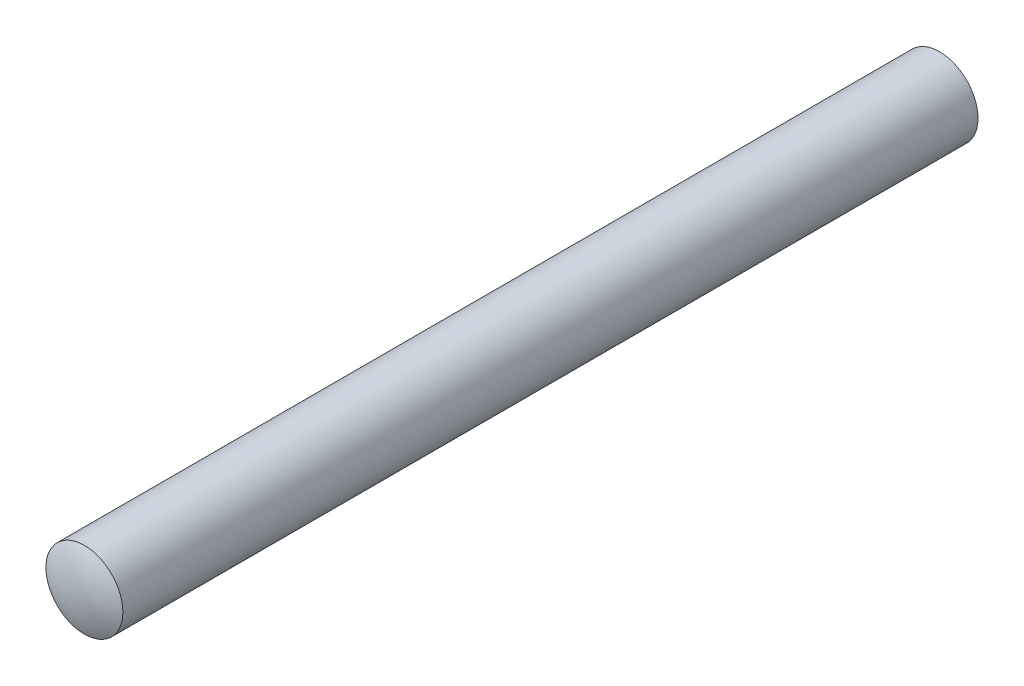
ISO-10303-21;
HEADER;
FILE_DESCRIPTION(('STEP AP214'),'2;1');
FILE_NAME('part.step','',(''),(''),'','','');
FILE_SCHEMA(('AUTOMOTIVE_DESIGN { 1 0 10303 214 1 1 1 1 }'));
ENDSEC;
DATA;
#1=APPLICATION_CONTEXT('core data for automotive mechanical design processes');
#2=APPLICATION_PROTOCOL_DEFINITION('international standard','automotive_design',2000,#1);
#3=PRODUCT_CONTEXT('',#1,'mechanical');
#4=PRODUCT('Part','Part','',(#3));
#5=PRODUCT_RELATED_PRODUCT_CATEGORY('part','',(#4));
#6=PRODUCT_DEFINITION_FORMATION('','',#4);
#7=PRODUCT_DEFINITION_CONTEXT('part definition',#1,'design');
#8=PRODUCT_DEFINITION('design','',#6,#7);
#9=PRODUCT_DEFINITION_SHAPE('','',#8);
#10=(LENGTH_UNIT() NAMED_UNIT(*) SI_UNIT(.MILLI.,.METRE.));
#11=(NAMED_UNIT(*) PLANE_ANGLE_UNIT() SI_UNIT($,.RADIAN.));
#12=(NAMED_UNIT(*) SI_UNIT($,.STERADIAN.) SOLID_ANGLE_UNIT());
#13=UNCERTAINTY_MEASURE_WITH_UNIT(LENGTH_MEASURE(1.E-05),#10,'distance_accuracy_value','');
#14=(GEOMETRIC_REPRESENTATION_CONTEXT(3) GLOBAL_UNCERTAINTY_ASSIGNED_CONTEXT((#13)) GLOBAL_UNIT_ASSIGNED_CONTEXT((#10,
#11,#12)) REPRESENTATION_CONTEXT('',''));
#15=CARTESIAN_POINT('',(0.,0.,0.));
#16=DIRECTION('',(0.,0.,1.));
#17=DIRECTION('',(1.,0.,0.));
#18=AXIS2_PLACEMENT_3D('',#15,#16,#17);
#19=CARTESIAN_POINT('',(0.,0.,-12.));
#20=DIRECTION('',(0.,0.,1.));
#21=DIRECTION('',(1.,0.,0.));
#22=AXIS2_PLACEMENT_3D('',#19,#20,#21);
#23=PLANE('',#22);
#24=CARTESIAN_POINT('',(0.,-0.0431561026006696,-12.));
#25=CARTESIAN_POINT('',(0.000738027913753445,-0.0431561302331545,-11.9999999995912));
#26=CARTESIAN_POINT('',(0.00147613825575498,-0.043139938985732,-11.9999999003416));
#27=CARTESIAN_POINT('',(0.00293869565083055,-0.0430740776249034,-11.9999995679615));
#28=CARTESIAN_POINT('',(0.00366316792066319,-0.0430249620105073,-11.9999993370578));
#29=CARTESIAN_POINT('',(0.00509847649352744,-0.0428932698491518,-11.9999988050516));
#30=CARTESIAN_POINT('',(0.00580935791370112,-0.0428111901512933,-11.9999985050187));
#31=CARTESIAN_POINT('',(0.00721745596068319,-0.0426136399648516,-11.9999978879299));
#32=CARTESIAN_POINT('',(0.00791473250792792,-0.0424985980707066,-11.9999975711327));
#33=CARTESIAN_POINT('',(0.00929561410342707,-0.0422351922605489,-11.9999969639851));
#34=CARTESIAN_POINT('',(0.00997928605881541,-0.0420871800361705,-11.9999966733981));
#35=CARTESIAN_POINT('',(0.0113329553281892,-0.0417579134016213,-11.9999961522564));
#36=CARTESIAN_POINT('',(0.0120030176612107,-0.0415769267139648,-11.9999959212521));
#37=CARTESIAN_POINT('',(0.0133294745552138,-0.0411817964598906,-11.999995543077));
#38=CARTESIAN_POINT('',(0.0139859223971284,-0.0409678319223546,-11.9999953954725));
#39=CARTESIAN_POINT('',(0.0152851665557313,-0.0405068352053947,-11.9999951981612));
#40=CARTESIAN_POINT('',(0.0159279941952508,-0.0402598913394465,-11.9999951481984));
#41=CARTESIAN_POINT('',(0.0172000241113151,-0.0397330260249969,-11.9999951505775));
#42=CARTESIAN_POINT('',(0.0178292257691308,-0.0394531030826817,-11.9999952029241));
#43=CARTESIAN_POINT('',(0.0190740392342978,-0.0388603675723207,-11.9999954047559));
#44=CARTESIAN_POINT('',(0.019689609374792,-0.0385474675281333,-11.9999955545052));
#45=CARTESIAN_POINT('',(0.0209072035810009,-0.0378888607225449,-11.9999959364923));
#46=CARTESIAN_POINT('',(0.0215091372813306,-0.0375429869994238,-11.9999961691683));
#47=CARTESIAN_POINT('',(0.0226995089919701,-0.0368185082402568,-11.9999966929573));
#48=CARTESIAN_POINT('',(0.0232878021974675,-0.0364396654761985,-11.999996984519));
#49=CARTESIAN_POINT('',(0.0244509477782236,-0.0356493141038548,-11.9999975927155));
#50=CARTESIAN_POINT('',(0.0250255973555137,-0.0352375073420272,-11.9999979095791));
#51=CARTESIAN_POINT('',(0.0261615129661012,-0.0343812836170717,-11.9999985257226));
#52=CARTESIAN_POINT('',(0.0267225169282215,-0.0339365193882482,-11.9999988247286));
#53=CARTESIAN_POINT('',(0.0278311977931707,-0.0330144201999962,-11.9999993534208));
#54=CARTESIAN_POINT('',(0.0283785542275349,-0.032536700390912,-11.9999995820145));
#55=CARTESIAN_POINT('',(0.0294599970777093,-0.0315487349040318,-11.9999999084644));
#56=CARTESIAN_POINT('',(0.0299937074717836,-0.031038078353483,-12.0000000040658));
#57=CARTESIAN_POINT('',(0.0310377530919818,-0.0299943521284331,-11.999999995938));
#58=CARTESIAN_POINT('',(0.0315481095665415,-0.0294613037096773,-11.999999892394));
#59=CARTESIAN_POINT('',(0.0325355352593085,-0.028381088182959,-11.9999995533055));
#60=CARTESIAN_POINT('',(0.033013012412825,-0.0278342946365927,-11.9999993199478));
#61=CARTESIAN_POINT('',(0.0339346964533898,-0.0267266557877198,-11.9999987837921));
#62=CARTESIAN_POINT('',(0.0343792847375511,-0.026166128226928,-11.9999984820475));
#63=CARTESIAN_POINT('',(0.0352352165779406,-0.0250310757578351,-11.9999978623258));
#64=CARTESIAN_POINT('',(0.035646903744466,-0.0244568102714911,-11.999997544596));
#65=CARTESIAN_POINT('',(0.0364370709240326,-0.0232943432663773,-11.9999969361502));
#66=CARTESIAN_POINT('',(0.0368158451840418,-0.0227063419565031,-11.9999966451931));
#67=CARTESIAN_POINT('',(0.0375402355410157,-0.0215164639371448,-11.9999961237629));
#68=CARTESIAN_POINT('',(0.0378860852657794,-0.0209147295755954,-11.9999958928396));
#69=CARTESIAN_POINT('',(0.0385446866461875,-0.0196974445695358,-11.9999955151694));
#70=CARTESIAN_POINT('',(0.0388576010276505,-0.0190819820185725,-11.9999953679909));
#71=CARTESIAN_POINT('',(0.039450401680091,-0.0178372955204561,-11.9999951717931));
#72=CARTESIAN_POINT('',(0.0397303711337779,-0.0172081112030847,-11.9999951225213));
#73=CARTESIAN_POINT('',(0.0402573599186174,-0.015936029746994,-11.9999951264778));
#74=CARTESIAN_POINT('',(0.0405043764808889,-0.0152931314612101,-11.9999951797148));
#75=CARTESIAN_POINT('',(0.0409655430992055,-0.013993662479238,-11.9999953834692));
#76=CARTESIAN_POINT('',(0.0411796007018864,-0.0133370589859167,-11.9999955342543));
#77=CARTESIAN_POINT('',(0.0415749358354243,-0.0120102105168703,-11.9999959184079));
#78=CARTESIAN_POINT('',(0.0417560304084033,-0.0113399110790786,-11.9999961522174));
#79=CARTESIAN_POINT('',(0.0420855258842836,-0.00998569154578158,-11.9999966783233));
#80=CARTESIAN_POINT('',(0.0422336554223524,-0.00930170553027065,-11.99999697107));
#81=CARTESIAN_POINT('',(0.0424973039838354,-0.0079201233098992,-11.9999975816394));
#82=CARTESIAN_POINT('',(0.0426124680239701,-0.00722245953577134,-11.9999978996911));
#83=CARTESIAN_POINT('',(0.0428102642790658,-0.00581352339534715,-11.9999985181561));
#84=CARTESIAN_POINT('',(0.0428924649781257,-0.00510219070143273,-11.9999988182943));
#85=CARTESIAN_POINT('',(0.0430244016240913,-0.00366590718270803,-11.9999993491387));
#86=CARTESIAN_POINT('',(0.0430736382817716,-0.0029409107919413,-11.9999995787498));
#87=CARTESIAN_POINT('',(0.0431397201394242,-0.00147729351109318,-11.9999999070042));
#88=CARTESIAN_POINT('',(0.0431560084803363,-0.000738647970511496,-12.0000000033873));
#89=CARTESIAN_POINT('',(0.0431561966535777,0.000738118826051634,-11.9999999966152));
#90=CARTESIAN_POINT('',(0.0431401196796694,0.00147624007855287,-11.9999998936028));
#91=CARTESIAN_POINT('',(0.0430744170623831,0.00293887874981491,-11.999999555477));
#92=CARTESIAN_POINT('',(0.0430253464008067,0.00366342060318055,-11.9999993225594));
#93=CARTESIAN_POINT('',(0.0428937228458304,0.00509886528252346,-11.9999987872095));
#94=CARTESIAN_POINT('',(0.042811666612918,0.00580981335929654,-11.9999984858359));
#95=CARTESIAN_POINT('',(0.0426141344131704,0.0072180505514258,-11.9999978668284));
#96=CARTESIAN_POINT('',(0.0424990870795411,0.00791539954051167,-11.9999975494436));
#97=CARTESIAN_POINT('',(0.0422356490294624,0.00929642263900966,-11.9999969416724));
#98=CARTESIAN_POINT('',(0.0420876100973526,0.00998016368440221,-11.9999966510438));
#99=CARTESIAN_POINT('',(0.0417582727623319,0.0113339639075386,-11.9999961302525));
#100=CARTESIAN_POINT('',(0.0415772422992361,0.0120040881633072,-11.9999958996367));
#101=CARTESIAN_POINT('',(0.0411820126211656,0.013330657110863,-11.9999955225464));
#102=CARTESIAN_POINT('',(0.0409679927912681,0.0139871551991759,-11.9999953756359));
#103=CARTESIAN_POINT('',(0.0405068790274284,0.0152864844353939,-11.999995179914));
#104=CARTESIAN_POINT('',(0.040259873922016,0.0159293470948334,-11.9999951308445));
#105=CARTESIAN_POINT('',(0.0397328853715718,0.0172014285736647,-11.9999951351162));
#106=CARTESIAN_POINT('',(0.0394529011171528,0.0178306470577468,-11.99999518846));
#107=CARTESIAN_POINT('',(0.0388600480926214,0.0190754733525341,-11.9999953923101));
#108=CARTESIAN_POINT('',(0.038547092702624,0.0196910398963783,-11.9999955430779));
#109=CARTESIAN_POINT('',(0.0378883863313595,0.0209086044689416,-11.9999959270562));
#110=CARTESIAN_POINT('',(0.0375424694105539,0.0215105126695731,-11.9999961607019));
#111=CARTESIAN_POINT('',(0.0368179214946978,0.0227008100891062,-11.9999966863271));
#112=CARTESIAN_POINT('',(0.0364390539464287,0.0232890551958006,-11.9999969787524));
#113=CARTESIAN_POINT('',(0.0356486764469173,0.0244520812659579,-11.9999975885261));
#114=CARTESIAN_POINT('',(0.0352368696508775,0.0250266602940098,-11.9999979061008));
#115=CARTESIAN_POINT('',(0.0343806754433505,0.0261624122168572,-11.9999985234863));
#116=CARTESIAN_POINT('',(0.0339359421853574,0.0267233240823886,-11.999998823022));
#117=CARTESIAN_POINT('',(0.0330139409890346,0.0278318001071768,-11.9999993525567));
#118=CARTESIAN_POINT('',(0.03253628971157,0.0283790450310677,-11.9999995814641));
#119=CARTESIAN_POINT('',(0.0315485024968345,0.0294602456978726,-11.9999999083662));
#120=CARTESIAN_POINT('',(0.031037957244087,0.0299938268257349,-12.0000000041105));
#121=CARTESIAN_POINT('',(0.0299940353368625,0.0310380717728396,-11.9999999958899));
#122=CARTESIAN_POINT('',(0.0294606607415807,0.0315487376505503,-11.9999998919429));
#123=CARTESIAN_POINT('',(0.0283798344449999,0.0325367104285917,-11.9999995513169));
#124=CARTESIAN_POINT('',(0.0278327587720454,0.0330144279633546,-11.9999993168499));
#125=CARTESIAN_POINT('',(0.0267245990537339,0.0339365261385512,-11.9999987780274));
#126=CARTESIAN_POINT('',(0.0261638350773552,0.0343812909757867,-11.9999984747395));
#127=CARTESIAN_POINT('',(0.0250283554610004,0.0352375157930711,-11.9999978516768));
#128=CARTESIAN_POINT('',(0.0244539013846031,0.0356493222309088,-11.9999975321551));
#129=CARTESIAN_POINT('',(0.0232911039789899,0.036439674054276,-11.9999969200614));
#130=CARTESIAN_POINT('',(0.0227029627929916,0.0368185165434587,-11.9999966272471));
#131=CARTESIAN_POINT('',(0.0215128521660523,0.0375429958212138,-11.9999961022017));
#132=CARTESIAN_POINT('',(0.020911026776971,0.037888869050409,-11.9999958695148));
#133=CARTESIAN_POINT('',(0.0196936063993934,0.0385474762464363,-11.9999954885589));
#134=CARTESIAN_POINT('',(0.0190781009634011,0.0388603756503271,-11.9999953398504));
#135=CARTESIAN_POINT('',(0.0178333741437629,0.0394531114721953,-11.9999951409541));
#136=CARTESIAN_POINT('',(0.017204193599175,0.0397330336229643,-11.9999950905054));
#137=CARTESIAN_POINT('',(0.0159321631529067,0.0402598991606373,-11.9999950925683));
#138=CARTESIAN_POINT('',(0.0152893130706333,0.0405068421115275,-11.9999951450813));
#139=CARTESIAN_POINT('',(0.0139899812263043,0.0409678389756018,-11.9999953479244));
#140=CARTESIAN_POINT('',(0.0133334674090633,0.0411818025035519,-11.9999954985176));
#141=CARTESIAN_POINT('',(0.0120068356846612,0.0415769328403167,-11.9999958828799));
#142=CARTESIAN_POINT('',(0.0113366638612629,0.041757918459736,-11.9999961170888));
#143=CARTESIAN_POINT('',(0.00998273262248294,0.0420871851268597,-11.999996644621));
#144=CARTESIAN_POINT('',(0.00929890766924199,0.0422351962600493,-11.9999969383971));
#145=CARTESIAN_POINT('',(0.00791767696709157,0.0424986020715844,-11.9999975516683));
#146=CARTESIAN_POINT('',(0.00722020391688941,0.0426136428913773,-11.9999978713985));
#147=CARTESIAN_POINT('',(0.00581166961365205,0.0428111930519013,-11.9999984938566));
#148=CARTESIAN_POINT('',(0.00510054816769507,0.0428932717078166,-11.9999987963178));
#149=CARTESIAN_POINT('',(0.00366471620717118,0.0430249638734061,-11.9999993324318));
#150=CARTESIAN_POINT('',(0.00293996041475778,0.0430740785637254,-11.9999995649991));
#151=CARTESIAN_POINT('',(0.00147679237950117,0.0431399398063584,-11.9999998997081));
#152=CARTESIAN_POINT('',(0.000738354846857928,0.0431561300400378,-11.9999999995984));
#153=CARTESIAN_POINT('',(0.,0.0431561026006694,-12.));
#154=B_SPLINE_CURVE_WITH_KNOTS('',3,(#24,#25,#26,#27,#28,#29,#30,#31,#32,#33,#34,#35,#36,#37,
#38,#39,#40,#41,#42,#43,#44,#45,#46,#47,#48,#49,#50,#51,#52,#53,#54,#55,#56,#57,#58,#59,#60,#61,
#62,#63,#64,#65,#66,#67,#68,#69,#70,#71,#72,#73,#74,#75,#76,#77,#78,#79,#80,#81,#82,#83,#84,#85,
#86,#87,#88,#89,#90,#91,#92,#93,#94,#95,#96,#97,#98,#99,#100,#101,#102,#103,#104,#105,#106,#107,
#108,#109,#110,#111,#112,#113,#114,#115,#116,#117,#118,#119,#120,#121,#122,#123,#124,#125,#126,
#127,#128,#129,#130,#131,#132,#133,#134,#135,#136,#137,#138,#139,#140,#141,#142,#143,#144,#145,
#146,#147,#148,#149,#150,#151,#152,#153),.UNSPECIFIED.,.F.,.F.,(4,2,2,2,2,2,2,2,2,2,2,2,2,2,2,2,
2,2,2,2,2,2,2,2,2,2,2,2,2,2,2,2,2,2,2,2,2,2,2,2,2,2,2,2,2,2,2,2,2,2,2,2,2,2,2,2,2,2,2,2,2,2,2,2,
4),(0.,0.00221402540277443,0.00439166977899523,0.00653765473057119,0.00865691268952945,
0.0107545638395147,0.0128358870392283,0.0149062852618709,0.0169712464749539,0.0190363012581055,
0.0211069787405895,0.0231887625920909,0.0252870487958252,0.0274071067728695,0.0295540451361771,
0.0317327829758524,0.0339480271662619,0.0361612140362444,0.0383381995056226,0.0404836894839922,
0.0426026009147173,0.0447000388619324,0.0467812676039475,0.0488516762396924,0.0509167397235037,
0.0529819766160398,0.0550529051234558,0.0571349991502957,0.0592336460895384,0.0613541079162974,
0.0635014868646143,0.0656806965930315,0.0678964393360112,0.0701105947897226,0.072288408233406,
0.074434590287091,0.0765540621422352,0.0786519324693625,0.0807334683540309,0.0828040607747248,
0.0848691855442754,0.0869343610074928,0.0890051040700715,0.0910868862847477,0.0931850917162463,
0.0953049781473741,0.0974516428998929,0.0996299941690186,0.101844728361522,0.104059263205386,
0.106237360026931,0.108383734263011,0.110503313485532,0.112601214547942,0.114682714701666,
0.116753217182551,0.118818212179586,0.120883234474957,0.122953819333574,0.125035458377705,
0.12713355718336,0.129253396179427,0.131400096142995,0.133578589208356,0.135793595895325),.UNSPECIFIED.);
#155=CARTESIAN_POINT('',(0.,-0.0431561026006696,-12.));
#156=VERTEX_POINT('',#155);
#157=CARTESIAN_POINT('',(0.,0.0431561026006695,-12.));
#158=VERTEX_POINT('',#157);
#159=EDGE_CURVE('E39',#156,#158,#154,.T.);
#160=ORIENTED_EDGE('',*,*,#159,.F.);
#161=CARTESIAN_POINT('',(0.,0.0431561026006694,-12.));
#162=CARTESIAN_POINT('',(-0.000738027913780117,0.0431561302331544,-11.9999999995912));
#163=CARTESIAN_POINT('',(-0.00147613825580804,0.0431399389857319,-11.9999999003416));
#164=CARTESIAN_POINT('',(-0.00293869565093238,0.0430740776249033,-11.9999995679615));
#165=CARTESIAN_POINT('',(-0.0036631679207874,0.0430249620105073,-11.9999993370578));
#166=CARTESIAN_POINT('',(-0.00509847649369311,0.0428932698491518,-11.9999988050516));
#167=CARTESIAN_POINT('',(-0.00580935791388588,0.0428111901512934,-11.9999985050187));
#168=CARTESIAN_POINT('',(-0.00721745596090281,0.0426136399648517,-11.9999978879299));
#169=CARTESIAN_POINT('',(-0.00791473250816332,0.0424985980707067,-11.9999975711327));
#170=CARTESIAN_POINT('',(-0.00929561410369112,0.042235192260549,-11.9999969639851));
#171=CARTESIAN_POINT('',(-0.00997928605909234,0.0420871800361708,-11.9999966733981));
#172=CARTESIAN_POINT('',(-0.0113329553284874,0.0417579134016217,-11.9999961522564));
#173=CARTESIAN_POINT('',(-0.0120030176615175,0.0415769267139652,-11.9999959212521));
#174=CARTESIAN_POINT('',(-0.0133294745555338,0.0411817964598909,-11.999995543077));
#175=CARTESIAN_POINT('',(-0.0139859223974533,0.0409678319223549,-11.9999953954725));
#176=CARTESIAN_POINT('',(-0.0152851665560629,0.040506835205395,-11.9999951981612));
#177=CARTESIAN_POINT('',(-0.0159279941955843,0.040259891339447,-11.9999951481984));
#178=CARTESIAN_POINT('',(-0.0172000241116488,0.0397330260249974,-11.9999951505775));
#179=CARTESIAN_POINT('',(-0.0178292257694627,0.0394531030826821,-11.9999952029241));
#180=CARTESIAN_POINT('',(-0.0190740392346232,0.0388603675723212,-11.9999954047559));
#181=CARTESIAN_POINT('',(-0.0196896093751129,0.038547467528134,-11.9999955545052));
#182=CARTESIAN_POINT('',(-0.020907203581308,0.0378888607225456,-11.9999959364923));
#183=CARTESIAN_POINT('',(-0.0215091372816286,0.0375429869994243,-11.9999961691683));
#184=CARTESIAN_POINT('',(-0.0226995089922469,0.0368185082402572,-11.9999966929573));
#185=CARTESIAN_POINT('',(-0.0232878021977325,0.0364396654761991,-11.999996984519));
#186=CARTESIAN_POINT('',(-0.0244509477784606,0.0356493141038555,-11.9999975927155));
#187=CARTESIAN_POINT('',(-0.0250255973557346,0.0352375073420279,-11.9999979095791));
#188=CARTESIAN_POINT('',(-0.026161512966287,0.0343812836170723,-11.9999985257226));
#189=CARTESIAN_POINT('',(-0.0267225169283883,0.0339365193882487,-11.9999988247286));
#190=CARTESIAN_POINT('',(-0.0278311977932965,0.0330144201999969,-11.9999993534208));
#191=CARTESIAN_POINT('',(-0.0283785542276387,0.032536700390913,-11.9999995820145));
#192=CARTESIAN_POINT('',(-0.029459997077764,0.0315487349040325,-11.9999999084644));
#193=CARTESIAN_POINT('',(-0.0299937074718113,0.0310380783534833,-12.0000000040658));
#194=CARTESIAN_POINT('',(-0.0310377530919379,0.0299943521284499,-11.999999995938));
#195=CARTESIAN_POINT('',(-0.0315481095664538,0.0294613037097117,-11.999999892394));
#196=CARTESIAN_POINT('',(-0.0325355352591389,0.0283810881830264,-11.9999995533055));
#197=CARTESIAN_POINT('',(-0.033013012412617,0.0278342946366752,-11.9999993199478));
#198=CARTESIAN_POINT('',(-0.0339346964531121,0.0267266557878307,-11.9999987837921));
#199=CARTESIAN_POINT('',(-0.0343792847372419,0.0261661282270519,-11.9999984820475));
#200=CARTESIAN_POINT('',(-0.0352352165775727,0.0250310757579824,-11.9999978623258));
#201=CARTESIAN_POINT('',(-0.0356469037440705,0.0244568102716485,-11.999997544596));
#202=CARTESIAN_POINT('',(-0.03643707092359,0.0232943432665534,-11.9999969361502));
#203=CARTESIAN_POINT('',(-0.0368158451835793,0.0227063419566876,-11.9999966451931));
#204=CARTESIAN_POINT('',(-0.0375402355405189,0.0215164639373437,-11.9999961237629));
#205=CARTESIAN_POINT('',(-0.0378860852652679,0.0209147295758,-11.9999958928396));
#206=CARTESIAN_POINT('',(-0.0385446866456521,0.0196974445697497,-11.9999955151694));
#207=CARTESIAN_POINT('',(-0.0388576010271054,0.0190819820187899,-11.999995367991));
#208=CARTESIAN_POINT('',(-0.0394504016795338,0.0178372955206783,-11.9999951717931));
#209=CARTESIAN_POINT('',(-0.0397303711332179,0.0172081112033082,-11.9999951225213));
#210=CARTESIAN_POINT('',(-0.0402573599180572,0.0159360297472176,-11.9999951264778));
#211=CARTESIAN_POINT('',(-0.0405043764803311,0.0152931314614325,-11.9999951797148));
#212=CARTESIAN_POINT('',(-0.0409655430986595,0.0139936624794558,-11.9999953834692));
#213=CARTESIAN_POINT('',(-0.0411796007013495,0.0133370589861311,-11.9999955342543));
#214=CARTESIAN_POINT('',(-0.0415749358349114,0.0120102105170755,-11.9999959184079));
#215=CARTESIAN_POINT('',(-0.0417560304079049,0.0113399110792779,-11.9999961522174));
#216=CARTESIAN_POINT('',(-0.0420855258838203,0.00998569154596676,-11.9999966783233));
#217=CARTESIAN_POINT('',(-0.0422336554219096,0.00930170553044767,-11.99999697107));
#218=CARTESIAN_POINT('',(-0.0424973039834387,0.00792012331005772,-11.9999975816394));
#219=CARTESIAN_POINT('',(-0.0426124680235991,0.00722245953591952,-11.9999978996911));
#220=CARTESIAN_POINT('',(-0.0428102642787532,0.00581352339547215,-11.9999985181561));
#221=CARTESIAN_POINT('',(-0.0428924649778458,0.00510219070154487,-11.9999988182943));
#222=CARTESIAN_POINT('',(-0.0430244016238815,0.00366590718279212,-11.9999993491387));
#223=CARTESIAN_POINT('',(-0.0430736382815992,0.00294091079201017,-11.9999995787498));
#224=CARTESIAN_POINT('',(-0.0431397201393348,0.00147729351112927,-11.9999999070042));
#225=CARTESIAN_POINT('',(-0.0431560084802927,0.000738647970529998,-12.0000000033873));
#226=CARTESIAN_POINT('',(-0.0431561966536224,-0.000738118826017241,-11.9999999966152));
#227=CARTESIAN_POINT('',(-0.043140119679759,-0.001476240078485,-11.9999998936028));
#228=CARTESIAN_POINT('',(-0.0430744170625549,-0.00293887874968432,-11.999999555477));
#229=CARTESIAN_POINT('',(-0.0430253464010158,-0.0036634206030207,-11.9999993225594));
#230=CARTESIAN_POINT('',(-0.0428937228461096,-0.00509886528230981,-11.9999987872095));
#231=CARTESIAN_POINT('',(-0.0428116666132299,-0.00580981335905831,-11.9999984858359));
#232=CARTESIAN_POINT('',(-0.0426141344135411,-0.00721805055114279,-11.9999978668284));
#233=CARTESIAN_POINT('',(-0.0424990870799379,-0.00791539954020844,-11.9999975494436));
#234=CARTESIAN_POINT('',(-0.0422356490299063,-0.00929642263867085,-11.9999969416724));
#235=CARTESIAN_POINT('',(-0.0420876100978173,-0.009980163684048,-11.9999966510438));
#236=CARTESIAN_POINT('',(-0.0417582727628313,-0.0113339639071577,-11.9999961302525));
#237=CARTESIAN_POINT('',(-0.0415772422997493,-0.0120040881629149,-11.9999958996366));
#238=CARTESIAN_POINT('',(-0.0411820126217015,-0.0133306571104528,-11.9999955225464));
#239=CARTESIAN_POINT('',(-0.040967992791813,-0.0139871551987591,-11.9999953756359));
#240=CARTESIAN_POINT('',(-0.0405068790279854,-0.0152864844349682,-11.999995179914));
#241=CARTESIAN_POINT('',(-0.040259873922576,-0.0159293470944055,-11.9999951308444));
#242=CARTESIAN_POINT('',(-0.0397328853721317,-0.0172014285732368,-11.9999951351162));
#243=CARTESIAN_POINT('',(-0.0394529011177092,-0.0178306470573211,-11.99999518846));
#244=CARTESIAN_POINT('',(-0.0388600480931666,-0.0190754733521176,-11.9999953923101));
#245=CARTESIAN_POINT('',(-0.038547092703161,-0.0196910398959686,-11.9999955430779));
#246=CARTESIAN_POINT('',(-0.0378883863318731,-0.02090860446855,-11.9999959270562));
#247=CARTESIAN_POINT('',(-0.0375424694110518,-0.0215105126691925,-11.9999961607019));
#248=CARTESIAN_POINT('',(-0.0368179214951598,-0.0227008100887525,-11.9999966863271));
#249=CARTESIAN_POINT('',(-0.03643905394687,-0.0232890551954625,-11.9999969787524));
#250=CARTESIAN_POINT('',(-0.0356486764473124,-0.0244520812656559,-11.9999975885261));
#251=CARTESIAN_POINT('',(-0.0352368696512468,-0.0250266602937279,-11.9999979061008));
#252=CARTESIAN_POINT('',(-0.0343806754436616,-0.0261624122166202,-11.9999985234863));
#253=CARTESIAN_POINT('',(-0.0339359421856358,-0.0267233240821761,-11.999998823022));
#254=CARTESIAN_POINT('',(-0.0330139409892425,-0.0278318001070181,-11.9999993525567));
#255=CARTESIAN_POINT('',(-0.0325362897117397,-0.0283790450309381,-11.9999995814641));
#256=CARTESIAN_POINT('',(-0.0315485024969227,-0.0294602456978061,-11.9999999083662));
#257=CARTESIAN_POINT('',(-0.0310379572441314,-0.0299938268257021,-12.0000000041105));
#258=CARTESIAN_POINT('',(-0.0299940353368518,-0.0310380717728393,-11.9999999958899));
#259=CARTESIAN_POINT('',(-0.0294606607415599,-0.0315487376505501,-11.9999998919429));
#260=CARTESIAN_POINT('',(-0.0283798344449601,-0.0325367104285916,-11.9999995513169));
#261=CARTESIAN_POINT('',(-0.0278327587719968,-0.0330144279633545,-11.9999993168499));
#262=CARTESIAN_POINT('',(-0.0267245990536693,-0.0339365261385511,-11.9999987780274));
#263=CARTESIAN_POINT('',(-0.0261638350772835,-0.0343812909757868,-11.9999984747395));
#264=CARTESIAN_POINT('',(-0.025028355460915,-0.0352375157930711,-11.9999978516768));
#265=CARTESIAN_POINT('',(-0.0244539013845111,-0.0356493222309086,-11.9999975321551));
#266=CARTESIAN_POINT('',(-0.0232911039788867,-0.0364396740542757,-11.9999969200614));
#267=CARTESIAN_POINT('',(-0.0227029627928838,-0.0368185165434585,-11.9999966272471));
#268=CARTESIAN_POINT('',(-0.0215128521659369,-0.0375429958212136,-11.9999961022017));
#269=CARTESIAN_POINT('',(-0.0209110267768525,-0.0378888690504089,-11.9999958695148));
#270=CARTESIAN_POINT('',(-0.0196936063992699,-0.0385474762464363,-11.9999954885589));
#271=CARTESIAN_POINT('',(-0.0190781009632758,-0.0388603756503271,-11.9999953398504));
#272=CARTESIAN_POINT('',(-0.0178333741436344,-0.0394531114721953,-11.9999951409541));
#273=CARTESIAN_POINT('',(-0.0172041935990454,-0.0397330336229642,-11.9999950905054));
#274=CARTESIAN_POINT('',(-0.0159321631527766,-0.0402598991606371,-11.9999950925683));
#275=CARTESIAN_POINT('',(-0.0152893130705039,-0.0405068421115274,-11.9999951450813));
#276=CARTESIAN_POINT('',(-0.0139899812261779,-0.0409678389756018,-11.9999953479244));
#277=CARTESIAN_POINT('',(-0.0133334674089392,-0.0411818025035518,-11.9999954985176));
#278=CARTESIAN_POINT('',(-0.0120068356845431,-0.0415769328403166,-11.9999958828799));
#279=CARTESIAN_POINT('',(-0.0113366638611484,-0.041757918459736,-11.9999961170888));
#280=CARTESIAN_POINT('',(-0.00998273262237677,-0.0420871851268598,-11.999996644621));
#281=CARTESIAN_POINT('',(-0.00929890766914034,-0.0422351962600493,-11.9999969383971));
#282=CARTESIAN_POINT('',(-0.00791767696700082,-0.0424986020715843,-11.9999975516683));
#283=CARTESIAN_POINT('',(-0.00722020391680507,-0.0426136428913774,-11.9999978713985));
#284=CARTESIAN_POINT('',(-0.00581166961358095,-0.0428111930519015,-11.9999984938566));
#285=CARTESIAN_POINT('',(-0.00510054816763079,-0.0428932717078167,-11.9999987963178));
#286=CARTESIAN_POINT('',(-0.00366471620712312,-0.0430249638734061,-11.9999993324318));
#287=CARTESIAN_POINT('',(-0.00293996041471913,-0.0430740785637255,-11.9999995649991));
#288=CARTESIAN_POINT('',(-0.00147679237948178,-0.0431399398063587,-11.9999998997081));
#289=CARTESIAN_POINT('',(-0.000738354846848395,-0.0431561300400381,-11.9999999995984));
#290=CARTESIAN_POINT('',(0.,-0.0431561026006696,-12.));
#291=B_SPLINE_CURVE_WITH_KNOTS('',3,(#161,#162,#163,#164,#165,#166,#167,#168,#169,#170,#171,
#172,#173,#174,#175,#176,#177,#178,#179,#180,#181,#182,#183,#184,#185,#186,#187,#188,#189,#190,
#191,#192,#193,#194,#195,#196,#197,#198,#199,#200,#201,#202,#203,#204,#205,#206,#207,#208,#209,
#210,#211,#212,#213,#214,#215,#216,#217,#218,#219,#220,#221,#222,#223,#224,#225,#226,#227,#228,
#229,#230,#231,#232,#233,#234,#235,#236,#237,#238,#239,#240,#241,#242,#243,#244,#245,#246,#247,
#248,#249,#250,#251,#252,#253,#254,#255,#256,#257,#258,#259,#260,#261,#262,#263,#264,#265,#266,
#267,#268,#269,#270,#271,#272,#273,#274,#275,#276,#277,#278,#279,#280,#281,#282,#283,#284,#285,
#286,#287,#288,#289,#290),.UNSPECIFIED.,.F.,.F.,(4,2,2,2,2,2,2,2,2,2,2,2,2,2,2,2,2,2,2,2,2,2,2,
2,2,2,2,2,2,2,2,2,2,2,2,2,2,2,2,2,2,2,2,2,2,2,2,2,2,2,2,2,2,2,2,2,2,2,2,2,2,2,2,2,4),(0.,
0.00221402540285359,0.00439166977914138,0.00653765473077421,0.00865691268977918,
0.0107545638398021,0.0128358870395402,0.0149062852621966,0.0169712464752848,0.0190363012584315,
0.0211069787409029,0.0231887625923806,0.0252870487960845,0.0274071067730895,0.0295540451363524,
0.0317327829759774,0.033948027166329,0.0361612140361825,0.0383381995054509,0.0404836894837311,
0.0426026009143838,0.0447000388615453,0.0467812676035238,0.0488516762392466,0.0509167397230513,
0.0529819766155936,0.0550529051230282,0.0571349991498968,0.0592336460891767,0.0613541079159791,
0.0635014868643458,0.0656806965928166,0.0678964393358522,0.07011059478946,0.072288408233048,
0.0744345902866482,0.0765540621417196,0.0786519324687881,0.0807334683534128,0.0828040607740793,
0.08486918554362,0.0869343610068474,0.0890051040694553,0.0910868862841835,0.093185091715755,
0.0953049781469772,0.0974516428996143,0.099629994168881,0.101844728361549,0.104059263205435,
0.106237360026999,0.108383734263096,0.110503313485633,0.112601214548055,0.114682714701787,
0.116753217182677,0.118818212179716,0.120883234475084,0.122953819333695,0.125035458377815,
0.127133557183457,0.129253396179505,0.131400096143052,0.133578589208385,0.135793595895325),.UNSPECIFIED.);
#292=EDGE_CURVE('E36',#158,#156,#291,.T.);
#293=ORIENTED_EDGE('',*,*,#292,.F.);
#294=EDGE_LOOP('',(#160,#293));
#295=FACE_BOUND('',#294,.T.);
#296=ADVANCED_FACE('F17',(#295),#23,.F.);
#297=CARTESIAN_POINT('',(0.,0.,-1.2));
#298=DIRECTION('',(0.,1.,0.));
#299=DIRECTION('',(0.,0.,1.));
#300=AXIS2_PLACEMENT_3D('',#297,#298,#299);
#301=SPHERICAL_SURFACE('',#300,1.2);
#302=CARTESIAN_POINT('',(0.,0.,-0.122893227205399));
#303=DIRECTION('',(0.,0.,1.));
#304=DIRECTION('',(1.,0.,0.));
#305=AXIS2_PLACEMENT_3D('',#302,#303,#304);
#306=CIRCLE('',#305,0.529);
#307=CARTESIAN_POINT('',(0.529,0.,-0.122893227205399));
#308=VERTEX_POINT('',#307);
#309=EDGE_CURVE('E11',#308,#308,#306,.F.);
#310=ORIENTED_EDGE('',*,*,#309,.F.);
#311=EDGE_LOOP('',(#310));
#312=FACE_BOUND('',#311,.T.);
#313=ADVANCED_FACE('F72',(#312),#301,.T.);
#314=CARTESIAN_POINT('',(0.,0.,-10.8007762715789));
#315=DIRECTION('',(0.,-1.,0.));
#316=DIRECTION('',(0.,0.,-1.));
#317=AXIS2_PLACEMENT_3D('',#314,#315,#316);
#318=SPHERICAL_SURFACE('',#317,1.2);
#319=CARTESIAN_POINT('',(0.,0.,-11.8778830443735));
#320=DIRECTION('',(0.,0.,1.));
#321=DIRECTION('',(1.,0.,0.));
#322=AXIS2_PLACEMENT_3D('',#319,#320,#321);
#323=CIRCLE('',#322,0.529);
#324=CARTESIAN_POINT('',(0.529,0.,-11.8778830443735));
#325=VERTEX_POINT('',#324);
#326=EDGE_CURVE('E29',#325,#325,#323,.T.);
#327=ORIENTED_EDGE('',*,*,#326,.F.);
#328=EDGE_LOOP('',(#327));
#329=FACE_BOUND('',#328,.T.);
#330=ORIENTED_EDGE('',*,*,#159,.T.);
#331=ORIENTED_EDGE('',*,*,#292,.T.);
#332=EDGE_LOOP('',(#330,#331));
#333=FACE_BOUND('',#332,.T.);
#334=ADVANCED_FACE('F46',(#329,#333),#318,.T.);
#335=CARTESIAN_POINT('',(0.,0.,-12.));
#336=DIRECTION('',(0.,0.,1.));
#337=DIRECTION('',(1.,0.,0.));
#338=AXIS2_PLACEMENT_3D('',#335,#336,#337);
#339=CYLINDRICAL_SURFACE('',#338,0.529);
#340=ORIENTED_EDGE('',*,*,#309,.T.);
#341=EDGE_LOOP('',(#340));
#342=FACE_BOUND('',#341,.T.);
#343=ORIENTED_EDGE('',*,*,#326,.T.);
#344=EDGE_LOOP('',(#343));
#345=FACE_BOUND('',#344,.T.);
#346=ADVANCED_FACE('F69',(#342,#345),#339,.T.);
#347=CLOSED_SHELL('',(#296,#313,#334,#346));
#348=MANIFOLD_SOLID_BREP('B1',#347);
#349=ADVANCED_BREP_SHAPE_REPRESENTATION('',(#18,#348),#14);
#350=SHAPE_DEFINITION_REPRESENTATION(#9,#349);
ENDSEC;
END-ISO-10303-21;
